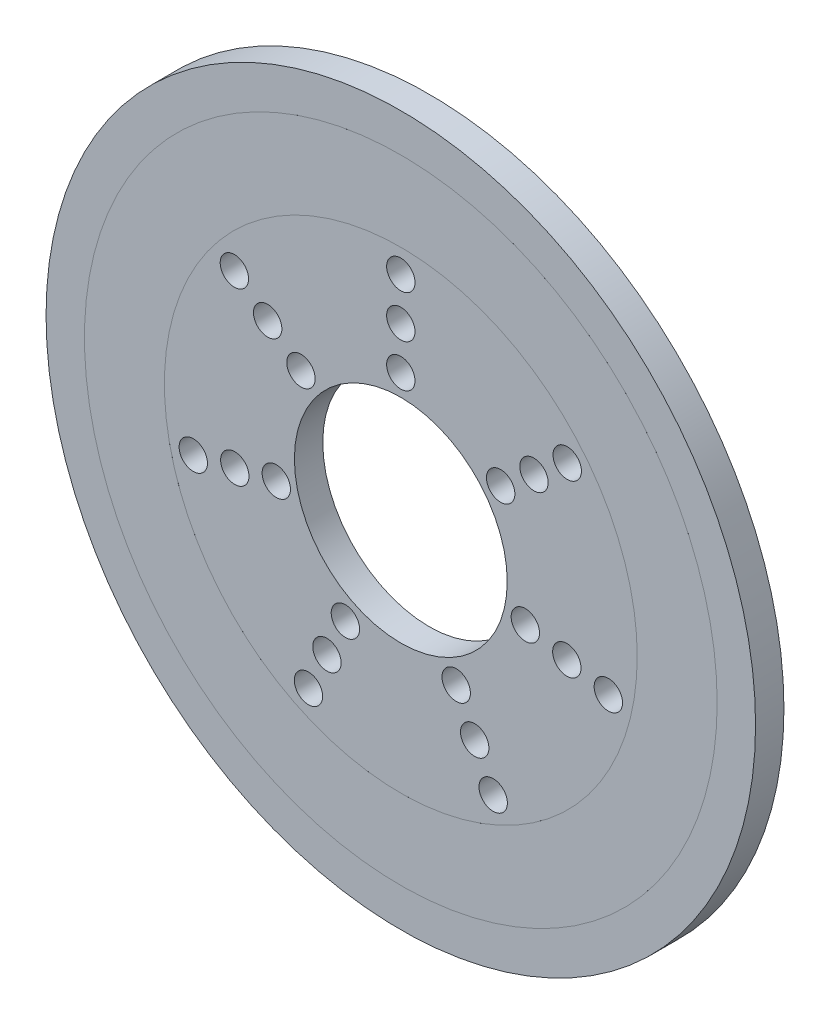
ISO-10303-21;
HEADER;
FILE_DESCRIPTION(('STEP AP214'),'2;1');
FILE_NAME('part.step','',(''),(''),'','','');
FILE_SCHEMA(('AUTOMOTIVE_DESIGN { 1 0 10303 214 1 1 1 1 }'));
ENDSEC;
DATA;
#1=APPLICATION_CONTEXT('core data for automotive mechanical design processes');
#2=APPLICATION_PROTOCOL_DEFINITION('international standard','automotive_design',2000,#1);
#3=PRODUCT_CONTEXT('',#1,'mechanical');
#4=PRODUCT('Part','Part','',(#3));
#5=PRODUCT_RELATED_PRODUCT_CATEGORY('part','',(#4));
#6=PRODUCT_DEFINITION_FORMATION('','',#4);
#7=PRODUCT_DEFINITION_CONTEXT('part definition',#1,'design');
#8=PRODUCT_DEFINITION('design','',#6,#7);
#9=PRODUCT_DEFINITION_SHAPE('','',#8);
#10=(LENGTH_UNIT() NAMED_UNIT(*) SI_UNIT(.MILLI.,.METRE.));
#11=(NAMED_UNIT(*) PLANE_ANGLE_UNIT() SI_UNIT($,.RADIAN.));
#12=(NAMED_UNIT(*) SI_UNIT($,.STERADIAN.) SOLID_ANGLE_UNIT());
#13=UNCERTAINTY_MEASURE_WITH_UNIT(LENGTH_MEASURE(1.E-05),#10,'distance_accuracy_value','');
#14=(GEOMETRIC_REPRESENTATION_CONTEXT(3) GLOBAL_UNCERTAINTY_ASSIGNED_CONTEXT((#13)) GLOBAL_UNIT_ASSIGNED_CONTEXT((#10,
#11,#12)) REPRESENTATION_CONTEXT('',''));
#15=CARTESIAN_POINT('',(0.,0.,0.));
#16=DIRECTION('',(0.,0.,1.));
#17=DIRECTION('',(1.,0.,0.));
#18=AXIS2_PLACEMENT_3D('',#15,#16,#17);
#19=CARTESIAN_POINT('',(0.,0.,10.));
#20=DIRECTION('',(0.,0.,1.));
#21=DIRECTION('',(1.,0.,0.));
#22=AXIS2_PLACEMENT_3D('',#19,#20,#21);
#23=PLANE('',#22);
#24=CARTESIAN_POINT('',(-46.9098889480758,37.4093881115113,10.));
#25=DIRECTION('',(0.,0.,1.));
#26=DIRECTION('',(1.,0.,0.));
#27=AXIS2_PLACEMENT_3D('',#24,#25,#26);
#28=CIRCLE('',#27,5.);
#29=CARTESIAN_POINT('',(-41.9098889480758,37.4093881115113,10.));
#30=VERTEX_POINT('',#29);
#31=EDGE_CURVE('E62',#30,#30,#28,.T.);
#32=ORIENTED_EDGE('',*,*,#31,.F.);
#33=EDGE_LOOP('',(#32));
#34=FACE_BOUND('',#33,.T.);
#35=CARTESIAN_POINT('',(-73.119593413617,-16.6890700467394,10.));
#36=DIRECTION('',(0.,0.,1.));
#37=DIRECTION('',(1.,0.,0.));
#38=AXIS2_PLACEMENT_3D('',#35,#36,#37);
#39=CIRCLE('',#38,5.);
#40=CARTESIAN_POINT('',(-68.119593413617,-16.6890700467394,10.));
#41=VERTEX_POINT('',#40);
#42=EDGE_CURVE('E74',#41,#41,#39,.T.);
#43=ORIENTED_EDGE('',*,*,#42,.F.);
#44=EDGE_LOOP('',(#43));
#45=FACE_BOUND('',#44,.T.);
#46=CARTESIAN_POINT('',(-43.8717560481623,-10.0134420280499,10.));
#47=DIRECTION('',(0.,0.,1.));
#48=DIRECTION('',(1.,0.,0.));
#49=AXIS2_PLACEMENT_3D('',#46,#47,#48);
#50=CIRCLE('',#49,5.);
#51=CARTESIAN_POINT('',(-38.8717560481623,-10.0134420280499,10.));
#52=VERTEX_POINT('',#51);
#53=EDGE_CURVE('E86',#52,#52,#50,.T.);
#54=ORIENTED_EDGE('',*,*,#53,.F.);
#55=EDGE_LOOP('',(#54));
#56=FACE_BOUND('',#55,.T.);
#57=CARTESIAN_POINT('',(-26.0330243470227,-54.0581320741522,10.));
#58=DIRECTION('',(0.,0.,1.));
#59=DIRECTION('',(1.,0.,0.));
#60=AXIS2_PLACEMENT_3D('',#57,#58,#59);
#61=CIRCLE('',#60,5.);
#62=CARTESIAN_POINT('',(-21.0330243470227,-54.0581320741522,10.));
#63=VERTEX_POINT('',#62);
#64=EDGE_CURVE('E98',#63,#63,#61,.T.);
#65=ORIENTED_EDGE('',*,*,#64,.F.);
#66=EDGE_LOOP('',(#65));
#67=FACE_BOUND('',#66,.T.);
#68=CARTESIAN_POINT('',(32.5412804338476,-67.5726650926744,10.));
#69=DIRECTION('',(0.,0.,1.));
#70=DIRECTION('',(1.,0.,0.));
#71=AXIS2_PLACEMENT_3D('',#68,#69,#70);
#72=CIRCLE('',#71,5.);
#73=CARTESIAN_POINT('',(37.5412804338476,-67.5726650926744,10.));
#74=VERTEX_POINT('',#73);
#75=EDGE_CURVE('E110',#74,#74,#72,.T.);
#76=ORIENTED_EDGE('',*,*,#75,.F.);
#77=EDGE_LOOP('',(#76));
#78=FACE_BOUND('',#77,.T.);
#79=CARTESIAN_POINT('',(19.5247682603208,-40.5435990556019,10.));
#80=DIRECTION('',(0.,0.,1.));
#81=DIRECTION('',(1.,0.,0.));
#82=AXIS2_PLACEMENT_3D('',#79,#80,#81);
#83=CIRCLE('',#82,5.);
#84=CARTESIAN_POINT('',(24.5247682603208,-40.5435990556019,10.));
#85=VERTEX_POINT('',#84);
#86=EDGE_CURVE('E122',#85,#85,#83,.T.);
#87=ORIENTED_EDGE('',*,*,#86,.F.);
#88=EDGE_LOOP('',(#87));
#89=FACE_BOUND('',#88,.T.);
#90=CARTESIAN_POINT('',(58.4956747309292,-13.3512560373631,10.));
#91=DIRECTION('',(0.,0.,1.));
#92=DIRECTION('',(1.,0.,0.));
#93=AXIS2_PLACEMENT_3D('',#90,#91,#92);
#94=CIRCLE('',#93,5.);
#95=CARTESIAN_POINT('',(63.4956747309292,-13.3512560373631,10.));
#96=VERTEX_POINT('',#95);
#97=EDGE_CURVE('E134',#96,#96,#94,.T.);
#98=ORIENTED_EDGE('',*,*,#97,.F.);
#99=EDGE_LOOP('',(#98));
#100=FACE_BOUND('',#99,.T.);
#101=CARTESIAN_POINT('',(58.6373611851082,46.7617351394177,10.));
#102=DIRECTION('',(0.,0.,1.));
#103=DIRECTION('',(1.,0.,0.));
#104=AXIS2_PLACEMENT_3D('',#101,#102,#103);
#105=CIRCLE('',#104,5.00000000000001);
#106=CARTESIAN_POINT('',(63.6373611851083,46.7617351394177,10.));
#107=VERTEX_POINT('',#106);
#108=EDGE_CURVE('E146',#107,#107,#105,.T.);
#109=ORIENTED_EDGE('',*,*,#108,.F.);
#110=EDGE_LOOP('',(#109));
#111=FACE_BOUND('',#110,.T.);
#112=CARTESIAN_POINT('',(35.1824167110674,28.0570410836556,10.));
#113=DIRECTION('',(0.,0.,1.));
#114=DIRECTION('',(1.,0.,0.));
#115=AXIS2_PLACEMENT_3D('',#112,#113,#114);
#116=CIRCLE('',#115,5.);
#117=CARTESIAN_POINT('',(40.1824167110674,28.0570410836556,10.));
#118=VERTEX_POINT('',#117);
#119=EDGE_CURVE('E158',#118,#118,#116,.T.);
#120=ORIENTED_EDGE('',*,*,#119,.F.);
#121=EDGE_LOOP('',(#120));
#122=FACE_BOUND('',#121,.T.);
#123=CARTESIAN_POINT('',(0.,60.,10.));
#124=DIRECTION('',(0.,0.,1.));
#125=DIRECTION('',(1.,0.,0.));
#126=AXIS2_PLACEMENT_3D('',#123,#124,#125);
#127=CIRCLE('',#126,5.);
#128=CARTESIAN_POINT('',(4.99999999999995,60.,10.));
#129=VERTEX_POINT('',#128);
#130=EDGE_CURVE('E170',#129,#129,#127,.T.);
#131=ORIENTED_EDGE('',*,*,#130,.F.);
#132=EDGE_LOOP('',(#131));
#133=FACE_BOUND('',#132,.T.);
#134=CARTESIAN_POINT('',(0.,0.,10.));
#135=DIRECTION('',(0.,0.,1.));
#136=DIRECTION('',(1.,0.,0.));
#137=AXIS2_PLACEMENT_3D('',#134,#135,#136);
#138=CIRCLE('',#137,37.5);
#139=CARTESIAN_POINT('',(37.5,0.,10.));
#140=VERTEX_POINT('',#139);
#141=EDGE_CURVE('E182',#140,#140,#138,.T.);
#142=ORIENTED_EDGE('',*,*,#141,.F.);
#143=EDGE_LOOP('',(#142));
#144=FACE_BOUND('',#143,.T.);
#145=CARTESIAN_POINT('',(0.,45.,10.));
#146=DIRECTION('',(0.,0.,1.));
#147=DIRECTION('',(1.,0.,0.));
#148=AXIS2_PLACEMENT_3D('',#145,#146,#147);
#149=CIRCLE('',#148,5.);
#150=CARTESIAN_POINT('',(5.,45.,10.));
#151=VERTEX_POINT('',#150);
#152=EDGE_CURVE('E176',#151,#151,#149,.T.);
#153=ORIENTED_EDGE('',*,*,#152,.F.);
#154=EDGE_LOOP('',(#153));
#155=FACE_BOUND('',#154,.T.);
#156=CARTESIAN_POINT('',(-1.04744440165294E-13,75.,10.));
#157=DIRECTION('',(0.,0.,1.));
#158=DIRECTION('',(1.,0.,0.));
#159=AXIS2_PLACEMENT_3D('',#156,#157,#158);
#160=CIRCLE('',#159,5.);
#161=CARTESIAN_POINT('',(4.9999999999999,75.,10.));
#162=VERTEX_POINT('',#161);
#163=EDGE_CURVE('E164',#162,#162,#160,.T.);
#164=ORIENTED_EDGE('',*,*,#163,.F.);
#165=EDGE_LOOP('',(#164));
#166=FACE_BOUND('',#165,.T.);
#167=CARTESIAN_POINT('',(46.9098889480878,37.4093881115367,10.));
#168=DIRECTION('',(0.,0.,1.));
#169=DIRECTION('',(1.,0.,0.));
#170=AXIS2_PLACEMENT_3D('',#167,#168,#169);
#171=CIRCLE('',#170,5.);
#172=CARTESIAN_POINT('',(51.9098889480878,37.4093881115367,10.));
#173=VERTEX_POINT('',#172);
#174=EDGE_CURVE('E152',#173,#173,#171,.T.);
#175=ORIENTED_EDGE('',*,*,#174,.F.);
#176=EDGE_LOOP('',(#175));
#177=FACE_BOUND('',#176,.T.);
#178=CARTESIAN_POINT('',(43.8717560482018,-10.0134420280184,10.));
#179=DIRECTION('',(0.,0.,1.));
#180=DIRECTION('',(1.,0.,0.));
#181=AXIS2_PLACEMENT_3D('',#178,#179,#180);
#182=CIRCLE('',#181,5.);
#183=CARTESIAN_POINT('',(48.8717560482018,-10.0134420280184,10.));
#184=VERTEX_POINT('',#183);
#185=EDGE_CURVE('E140',#184,#184,#182,.T.);
#186=ORIENTED_EDGE('',*,*,#185,.F.);
#187=EDGE_LOOP('',(#186));
#188=FACE_BOUND('',#187,.T.);
#189=CARTESIAN_POINT('',(73.1195934136565,-16.6890700467077,10.));
#190=DIRECTION('',(0.,0.,1.));
#191=DIRECTION('',(1.,0.,0.));
#192=AXIS2_PLACEMENT_3D('',#189,#190,#191);
#193=CIRCLE('',#192,5.);
#194=CARTESIAN_POINT('',(78.1195934136565,-16.6890700467077,10.));
#195=VERTEX_POINT('',#194);
#196=EDGE_CURVE('E128',#195,#195,#193,.T.);
#197=ORIENTED_EDGE('',*,*,#196,.F.);
#198=EDGE_LOOP('',(#197));
#199=FACE_BOUND('',#198,.T.);
#200=CARTESIAN_POINT('',(26.0330243470842,-54.0581320741381,10.));
#201=DIRECTION('',(0.,0.,1.));
#202=DIRECTION('',(1.,0.,0.));
#203=AXIS2_PLACEMENT_3D('',#200,#201,#202);
#204=CIRCLE('',#203,5.);
#205=CARTESIAN_POINT('',(31.0330243470842,-54.0581320741381,10.));
#206=VERTEX_POINT('',#205);
#207=EDGE_CURVE('E116',#206,#206,#204,.T.);
#208=ORIENTED_EDGE('',*,*,#207,.F.);
#209=EDGE_LOOP('',(#208));
#210=FACE_BOUND('',#209,.T.);
#211=CARTESIAN_POINT('',(-19.5247682602594,-40.5435990556159,10.));
#212=DIRECTION('',(0.,0.,1.));
#213=DIRECTION('',(1.,0.,0.));
#214=AXIS2_PLACEMENT_3D('',#211,#212,#213);
#215=CIRCLE('',#214,5.);
#216=CARTESIAN_POINT('',(-14.5247682602594,-40.5435990556159,10.));
#217=VERTEX_POINT('',#216);
#218=EDGE_CURVE('E104',#217,#217,#215,.T.);
#219=ORIENTED_EDGE('',*,*,#218,.F.);
#220=EDGE_LOOP('',(#219));
#221=FACE_BOUND('',#220,.T.);
#222=CARTESIAN_POINT('',(-32.5412804337861,-67.5726650926885,10.));
#223=DIRECTION('',(0.,0.,1.));
#224=DIRECTION('',(1.,0.,0.));
#225=AXIS2_PLACEMENT_3D('',#222,#223,#224);
#226=CIRCLE('',#225,5.);
#227=CARTESIAN_POINT('',(-27.5412804337861,-67.5726650926885,10.));
#228=VERTEX_POINT('',#227);
#229=EDGE_CURVE('E92',#228,#228,#226,.T.);
#230=ORIENTED_EDGE('',*,*,#229,.F.);
#231=EDGE_LOOP('',(#230));
#232=FACE_BOUND('',#231,.T.);
#233=CARTESIAN_POINT('',(-58.4956747308897,-13.3512560373947,10.));
#234=DIRECTION('',(0.,0.,1.));
#235=DIRECTION('',(1.,0.,0.));
#236=AXIS2_PLACEMENT_3D('',#233,#234,#235);
#237=CIRCLE('',#236,5.);
#238=CARTESIAN_POINT('',(-53.4956747308897,-13.3512560373947,10.));
#239=VERTEX_POINT('',#238);
#240=EDGE_CURVE('E80',#239,#239,#237,.T.);
#241=ORIENTED_EDGE('',*,*,#240,.F.);
#242=EDGE_LOOP('',(#241));
#243=FACE_BOUND('',#242,.T.);
#244=CARTESIAN_POINT('',(-35.1824167110553,28.0570410836304,10.));
#245=DIRECTION('',(0.,0.,1.));
#246=DIRECTION('',(1.,0.,0.));
#247=AXIS2_PLACEMENT_3D('',#244,#245,#246);
#248=CIRCLE('',#247,5.);
#249=CARTESIAN_POINT('',(-30.1824167110553,28.0570410836304,10.));
#250=VERTEX_POINT('',#249);
#251=EDGE_CURVE('E68',#250,#250,#248,.T.);
#252=ORIENTED_EDGE('',*,*,#251,.F.);
#253=EDGE_LOOP('',(#252));
#254=FACE_BOUND('',#253,.T.);
#255=CARTESIAN_POINT('',(-58.6373611850962,46.7617351393923,10.));
#256=DIRECTION('',(0.,0.,1.));
#257=DIRECTION('',(1.,0.,0.));
#258=AXIS2_PLACEMENT_3D('',#255,#256,#257);
#259=CIRCLE('',#258,5.);
#260=CARTESIAN_POINT('',(-53.6373611850962,46.7617351393923,10.));
#261=VERTEX_POINT('',#260);
#262=EDGE_CURVE('E55',#261,#261,#259,.T.);
#263=ORIENTED_EDGE('',*,*,#262,.F.);
#264=EDGE_LOOP('',(#263));
#265=FACE_BOUND('',#264,.T.);
#266=CARTESIAN_POINT('',(0.,0.,10.));
#267=DIRECTION('',(0.,0.,1.));
#268=DIRECTION('',(1.,0.,0.));
#269=AXIS2_PLACEMENT_3D('',#266,#267,#268);
#270=CIRCLE('',#269,83.3035848623197);
#271=CARTESIAN_POINT('',(83.3035848623197,0.,10.));
#272=VERTEX_POINT('',#271);
#273=EDGE_CURVE('E335',#272,#272,#270,.T.);
#274=ORIENTED_EDGE('',*,*,#273,.T.);
#275=EDGE_LOOP('',(#274));
#276=FACE_BOUND('',#275,.T.);
#277=ADVANCED_FACE('F31',(#34,#45,#56,#67,#78,#89,#100,#111,#122,#133,#144,#155,#166,#177,#188,
#199,#210,#221,#232,#243,#254,#265,#276),#23,.T.);
#278=CARTESIAN_POINT('',(0.,0.,0.));
#279=DIRECTION('',(0.,0.,1.));
#280=DIRECTION('',(1.,0.,0.));
#281=AXIS2_PLACEMENT_3D('',#278,#279,#280);
#282=PLANE('',#281);
#283=CARTESIAN_POINT('',(-58.6373611850962,46.7617351393923,0.));
#284=DIRECTION('',(0.,0.,1.));
#285=DIRECTION('',(1.,0.,0.));
#286=AXIS2_PLACEMENT_3D('',#283,#284,#285);
#287=CIRCLE('',#286,5.);
#288=CARTESIAN_POINT('',(-53.6373611850962,46.7617351393923,0.));
#289=VERTEX_POINT('',#288);
#290=EDGE_CURVE('E59',#289,#289,#287,.T.);
#291=ORIENTED_EDGE('',*,*,#290,.T.);
#292=EDGE_LOOP('',(#291));
#293=FACE_BOUND('',#292,.T.);
#294=CARTESIAN_POINT('',(-46.9098889480758,37.4093881115113,0.));
#295=DIRECTION('',(0.,0.,1.));
#296=DIRECTION('',(1.,0.,0.));
#297=AXIS2_PLACEMENT_3D('',#294,#295,#296);
#298=CIRCLE('',#297,5.);
#299=CARTESIAN_POINT('',(-41.9098889480758,37.4093881115113,0.));
#300=VERTEX_POINT('',#299);
#301=EDGE_CURVE('E58',#300,#300,#298,.T.);
#302=ORIENTED_EDGE('',*,*,#301,.T.);
#303=EDGE_LOOP('',(#302));
#304=FACE_BOUND('',#303,.T.);
#305=CARTESIAN_POINT('',(-35.1824167110553,28.0570410836304,0.));
#306=DIRECTION('',(0.,0.,1.));
#307=DIRECTION('',(1.,0.,0.));
#308=AXIS2_PLACEMENT_3D('',#305,#306,#307);
#309=CIRCLE('',#308,5.);
#310=CARTESIAN_POINT('',(-30.1824167110553,28.0570410836304,0.));
#311=VERTEX_POINT('',#310);
#312=EDGE_CURVE('E65',#311,#311,#309,.T.);
#313=ORIENTED_EDGE('',*,*,#312,.T.);
#314=EDGE_LOOP('',(#313));
#315=FACE_BOUND('',#314,.T.);
#316=CARTESIAN_POINT('',(-73.119593413617,-16.6890700467394,0.));
#317=DIRECTION('',(0.,0.,1.));
#318=DIRECTION('',(1.,0.,0.));
#319=AXIS2_PLACEMENT_3D('',#316,#317,#318);
#320=CIRCLE('',#319,5.);
#321=CARTESIAN_POINT('',(-68.119593413617,-16.6890700467394,0.));
#322=VERTEX_POINT('',#321);
#323=EDGE_CURVE('E71',#322,#322,#320,.T.);
#324=ORIENTED_EDGE('',*,*,#323,.T.);
#325=EDGE_LOOP('',(#324));
#326=FACE_BOUND('',#325,.T.);
#327=CARTESIAN_POINT('',(-58.4956747308897,-13.3512560373947,0.));
#328=DIRECTION('',(0.,0.,1.));
#329=DIRECTION('',(1.,0.,0.));
#330=AXIS2_PLACEMENT_3D('',#327,#328,#329);
#331=CIRCLE('',#330,5.);
#332=CARTESIAN_POINT('',(-53.4956747308897,-13.3512560373947,0.));
#333=VERTEX_POINT('',#332);
#334=EDGE_CURVE('E77',#333,#333,#331,.T.);
#335=ORIENTED_EDGE('',*,*,#334,.T.);
#336=EDGE_LOOP('',(#335));
#337=FACE_BOUND('',#336,.T.);
#338=CARTESIAN_POINT('',(-43.8717560481623,-10.0134420280499,0.));
#339=DIRECTION('',(0.,0.,1.));
#340=DIRECTION('',(1.,0.,0.));
#341=AXIS2_PLACEMENT_3D('',#338,#339,#340);
#342=CIRCLE('',#341,5.);
#343=CARTESIAN_POINT('',(-38.8717560481623,-10.0134420280499,0.));
#344=VERTEX_POINT('',#343);
#345=EDGE_CURVE('E83',#344,#344,#342,.T.);
#346=ORIENTED_EDGE('',*,*,#345,.T.);
#347=EDGE_LOOP('',(#346));
#348=FACE_BOUND('',#347,.T.);
#349=CARTESIAN_POINT('',(-32.5412804337861,-67.5726650926885,0.));
#350=DIRECTION('',(0.,0.,1.));
#351=DIRECTION('',(1.,0.,0.));
#352=AXIS2_PLACEMENT_3D('',#349,#350,#351);
#353=CIRCLE('',#352,5.);
#354=CARTESIAN_POINT('',(-27.5412804337861,-67.5726650926885,0.));
#355=VERTEX_POINT('',#354);
#356=EDGE_CURVE('E89',#355,#355,#353,.T.);
#357=ORIENTED_EDGE('',*,*,#356,.T.);
#358=EDGE_LOOP('',(#357));
#359=FACE_BOUND('',#358,.T.);
#360=CARTESIAN_POINT('',(-26.0330243470227,-54.0581320741522,0.));
#361=DIRECTION('',(0.,0.,1.));
#362=DIRECTION('',(1.,0.,0.));
#363=AXIS2_PLACEMENT_3D('',#360,#361,#362);
#364=CIRCLE('',#363,5.);
#365=CARTESIAN_POINT('',(-21.0330243470227,-54.0581320741522,0.));
#366=VERTEX_POINT('',#365);
#367=EDGE_CURVE('E95',#366,#366,#364,.T.);
#368=ORIENTED_EDGE('',*,*,#367,.T.);
#369=EDGE_LOOP('',(#368));
#370=FACE_BOUND('',#369,.T.);
#371=CARTESIAN_POINT('',(-19.5247682602594,-40.5435990556159,0.));
#372=DIRECTION('',(0.,0.,1.));
#373=DIRECTION('',(1.,0.,0.));
#374=AXIS2_PLACEMENT_3D('',#371,#372,#373);
#375=CIRCLE('',#374,5.);
#376=CARTESIAN_POINT('',(-14.5247682602594,-40.5435990556159,0.));
#377=VERTEX_POINT('',#376);
#378=EDGE_CURVE('E101',#377,#377,#375,.T.);
#379=ORIENTED_EDGE('',*,*,#378,.T.);
#380=EDGE_LOOP('',(#379));
#381=FACE_BOUND('',#380,.T.);
#382=CARTESIAN_POINT('',(32.5412804338476,-67.5726650926744,0.));
#383=DIRECTION('',(0.,0.,1.));
#384=DIRECTION('',(1.,0.,0.));
#385=AXIS2_PLACEMENT_3D('',#382,#383,#384);
#386=CIRCLE('',#385,5.);
#387=CARTESIAN_POINT('',(37.5412804338476,-67.5726650926744,0.));
#388=VERTEX_POINT('',#387);
#389=EDGE_CURVE('E107',#388,#388,#386,.T.);
#390=ORIENTED_EDGE('',*,*,#389,.T.);
#391=EDGE_LOOP('',(#390));
#392=FACE_BOUND('',#391,.T.);
#393=CARTESIAN_POINT('',(26.0330243470842,-54.0581320741381,0.));
#394=DIRECTION('',(0.,0.,1.));
#395=DIRECTION('',(1.,0.,0.));
#396=AXIS2_PLACEMENT_3D('',#393,#394,#395);
#397=CIRCLE('',#396,5.);
#398=CARTESIAN_POINT('',(31.0330243470842,-54.0581320741381,0.));
#399=VERTEX_POINT('',#398);
#400=EDGE_CURVE('E113',#399,#399,#397,.T.);
#401=ORIENTED_EDGE('',*,*,#400,.T.);
#402=EDGE_LOOP('',(#401));
#403=FACE_BOUND('',#402,.T.);
#404=CARTESIAN_POINT('',(19.5247682603208,-40.5435990556019,0.));
#405=DIRECTION('',(0.,0.,1.));
#406=DIRECTION('',(1.,0.,0.));
#407=AXIS2_PLACEMENT_3D('',#404,#405,#406);
#408=CIRCLE('',#407,5.);
#409=CARTESIAN_POINT('',(24.5247682603208,-40.5435990556019,0.));
#410=VERTEX_POINT('',#409);
#411=EDGE_CURVE('E119',#410,#410,#408,.T.);
#412=ORIENTED_EDGE('',*,*,#411,.T.);
#413=EDGE_LOOP('',(#412));
#414=FACE_BOUND('',#413,.T.);
#415=CARTESIAN_POINT('',(73.1195934136565,-16.6890700467077,0.));
#416=DIRECTION('',(0.,0.,1.));
#417=DIRECTION('',(1.,0.,0.));
#418=AXIS2_PLACEMENT_3D('',#415,#416,#417);
#419=CIRCLE('',#418,5.);
#420=CARTESIAN_POINT('',(78.1195934136565,-16.6890700467077,0.));
#421=VERTEX_POINT('',#420);
#422=EDGE_CURVE('E125',#421,#421,#419,.T.);
#423=ORIENTED_EDGE('',*,*,#422,.T.);
#424=EDGE_LOOP('',(#423));
#425=FACE_BOUND('',#424,.T.);
#426=CARTESIAN_POINT('',(58.4956747309292,-13.3512560373631,0.));
#427=DIRECTION('',(0.,0.,1.));
#428=DIRECTION('',(1.,0.,0.));
#429=AXIS2_PLACEMENT_3D('',#426,#427,#428);
#430=CIRCLE('',#429,5.);
#431=CARTESIAN_POINT('',(63.4956747309292,-13.3512560373631,0.));
#432=VERTEX_POINT('',#431);
#433=EDGE_CURVE('E131',#432,#432,#430,.T.);
#434=ORIENTED_EDGE('',*,*,#433,.T.);
#435=EDGE_LOOP('',(#434));
#436=FACE_BOUND('',#435,.T.);
#437=CARTESIAN_POINT('',(43.8717560482018,-10.0134420280184,0.));
#438=DIRECTION('',(0.,0.,1.));
#439=DIRECTION('',(1.,0.,0.));
#440=AXIS2_PLACEMENT_3D('',#437,#438,#439);
#441=CIRCLE('',#440,5.);
#442=CARTESIAN_POINT('',(48.8717560482018,-10.0134420280184,0.));
#443=VERTEX_POINT('',#442);
#444=EDGE_CURVE('E137',#443,#443,#441,.T.);
#445=ORIENTED_EDGE('',*,*,#444,.T.);
#446=EDGE_LOOP('',(#445));
#447=FACE_BOUND('',#446,.T.);
#448=CARTESIAN_POINT('',(58.6373611851082,46.7617351394177,0.));
#449=DIRECTION('',(0.,0.,1.));
#450=DIRECTION('',(1.,0.,0.));
#451=AXIS2_PLACEMENT_3D('',#448,#449,#450);
#452=CIRCLE('',#451,5.00000000000001);
#453=CARTESIAN_POINT('',(63.6373611851083,46.7617351394177,0.));
#454=VERTEX_POINT('',#453);
#455=EDGE_CURVE('E143',#454,#454,#452,.T.);
#456=ORIENTED_EDGE('',*,*,#455,.T.);
#457=EDGE_LOOP('',(#456));
#458=FACE_BOUND('',#457,.T.);
#459=CARTESIAN_POINT('',(46.9098889480878,37.4093881115367,0.));
#460=DIRECTION('',(0.,0.,1.));
#461=DIRECTION('',(1.,0.,0.));
#462=AXIS2_PLACEMENT_3D('',#459,#460,#461);
#463=CIRCLE('',#462,5.);
#464=CARTESIAN_POINT('',(51.9098889480878,37.4093881115367,0.));
#465=VERTEX_POINT('',#464);
#466=EDGE_CURVE('E149',#465,#465,#463,.T.);
#467=ORIENTED_EDGE('',*,*,#466,.T.);
#468=EDGE_LOOP('',(#467));
#469=FACE_BOUND('',#468,.T.);
#470=CARTESIAN_POINT('',(35.1824167110674,28.0570410836556,0.));
#471=DIRECTION('',(0.,0.,1.));
#472=DIRECTION('',(1.,0.,0.));
#473=AXIS2_PLACEMENT_3D('',#470,#471,#472);
#474=CIRCLE('',#473,5.);
#475=CARTESIAN_POINT('',(40.1824167110674,28.0570410836556,0.));
#476=VERTEX_POINT('',#475);
#477=EDGE_CURVE('E155',#476,#476,#474,.T.);
#478=ORIENTED_EDGE('',*,*,#477,.T.);
#479=EDGE_LOOP('',(#478));
#480=FACE_BOUND('',#479,.T.);
#481=CARTESIAN_POINT('',(-1.04744440165294E-13,75.,0.));
#482=DIRECTION('',(0.,0.,1.));
#483=DIRECTION('',(1.,0.,0.));
#484=AXIS2_PLACEMENT_3D('',#481,#482,#483);
#485=CIRCLE('',#484,5.);
#486=CARTESIAN_POINT('',(4.9999999999999,75.,0.));
#487=VERTEX_POINT('',#486);
#488=EDGE_CURVE('E161',#487,#487,#485,.T.);
#489=ORIENTED_EDGE('',*,*,#488,.T.);
#490=EDGE_LOOP('',(#489));
#491=FACE_BOUND('',#490,.T.);
#492=CARTESIAN_POINT('',(0.,60.,0.));
#493=DIRECTION('',(0.,0.,1.));
#494=DIRECTION('',(1.,0.,0.));
#495=AXIS2_PLACEMENT_3D('',#492,#493,#494);
#496=CIRCLE('',#495,5.);
#497=CARTESIAN_POINT('',(4.99999999999995,60.,0.));
#498=VERTEX_POINT('',#497);
#499=EDGE_CURVE('E167',#498,#498,#496,.T.);
#500=ORIENTED_EDGE('',*,*,#499,.T.);
#501=EDGE_LOOP('',(#500));
#502=FACE_BOUND('',#501,.T.);
#503=CARTESIAN_POINT('',(0.,45.,0.));
#504=DIRECTION('',(0.,0.,1.));
#505=DIRECTION('',(1.,0.,0.));
#506=AXIS2_PLACEMENT_3D('',#503,#504,#505);
#507=CIRCLE('',#506,5.);
#508=CARTESIAN_POINT('',(5.,45.,0.));
#509=VERTEX_POINT('',#508);
#510=EDGE_CURVE('E173',#509,#509,#507,.T.);
#511=ORIENTED_EDGE('',*,*,#510,.T.);
#512=EDGE_LOOP('',(#511));
#513=FACE_BOUND('',#512,.T.);
#514=CARTESIAN_POINT('',(0.,0.,0.));
#515=DIRECTION('',(0.,0.,1.));
#516=DIRECTION('',(1.,0.,0.));
#517=AXIS2_PLACEMENT_3D('',#514,#515,#516);
#518=CIRCLE('',#517,37.5);
#519=CARTESIAN_POINT('',(37.5,0.,0.));
#520=VERTEX_POINT('',#519);
#521=EDGE_CURVE('E179',#520,#520,#518,.T.);
#522=ORIENTED_EDGE('',*,*,#521,.T.);
#523=EDGE_LOOP('',(#522));
#524=FACE_BOUND('',#523,.T.);
#525=CARTESIAN_POINT('',(0.,0.,0.));
#526=DIRECTION('',(0.,0.,1.));
#527=DIRECTION('',(1.,0.,0.));
#528=AXIS2_PLACEMENT_3D('',#525,#526,#527);
#529=CIRCLE('',#528,83.3035848623197);
#530=CARTESIAN_POINT('',(83.3035848623197,0.,0.));
#531=VERTEX_POINT('',#530);
#532=EDGE_CURVE('E39',#531,#531,#529,.T.);
#533=ORIENTED_EDGE('',*,*,#532,.F.);
#534=EDGE_LOOP('',(#533));
#535=FACE_BOUND('',#534,.T.);
#536=ADVANCED_FACE('F198',(#293,#304,#315,#326,#337,#348,#359,#370,#381,#392,#403,#414,#425,
#436,#447,#458,#469,#480,#491,#502,#513,#524,#535),#282,.F.);
#537=CARTESIAN_POINT('',(0.,0.,10.));
#538=DIRECTION('',(0.,0.,1.));
#539=DIRECTION('',(1.,0.,0.));
#540=AXIS2_PLACEMENT_3D('',#537,#538,#539);
#541=CIRCLE('',#540,111.468965797541);
#542=CARTESIAN_POINT('',(111.468965797541,0.,10.));
#543=VERTEX_POINT('',#542);
#544=EDGE_CURVE('E10',#543,#543,#541,.T.);
#545=ORIENTED_EDGE('',*,*,#544,.F.);
#546=EDGE_LOOP('',(#545));
#547=FACE_BOUND('',#546,.T.);
#548=CARTESIAN_POINT('',(0.,0.,10.));
#549=DIRECTION('',(0.,0.,1.));
#550=DIRECTION('',(1.,0.,0.));
#551=AXIS2_PLACEMENT_3D('',#548,#549,#550);
#552=CIRCLE('',#551,125.);
#553=CARTESIAN_POINT('',(125.,0.,10.));
#554=VERTEX_POINT('',#553);
#555=EDGE_CURVE('E44',#554,#554,#552,.T.);
#556=ORIENTED_EDGE('',*,*,#555,.T.);
#557=EDGE_LOOP('',(#556));
#558=FACE_BOUND('',#557,.T.);
#559=ADVANCED_FACE('F196',(#547,#558),#23,.T.);
#560=CARTESIAN_POINT('',(0.,0.,0.));
#561=DIRECTION('',(0.,0.,1.));
#562=DIRECTION('',(1.,0.,0.));
#563=AXIS2_PLACEMENT_3D('',#560,#561,#562);
#564=CIRCLE('',#563,111.468965797541);
#565=CARTESIAN_POINT('',(111.468965797541,0.,0.));
#566=VERTEX_POINT('',#565);
#567=EDGE_CURVE('E35',#566,#566,#564,.T.);
#568=ORIENTED_EDGE('',*,*,#567,.T.);
#569=EDGE_LOOP('',(#568));
#570=FACE_BOUND('',#569,.T.);
#571=CARTESIAN_POINT('',(0.,0.,0.));
#572=DIRECTION('',(0.,0.,1.));
#573=DIRECTION('',(1.,0.,0.));
#574=AXIS2_PLACEMENT_3D('',#571,#572,#573);
#575=CIRCLE('',#574,125.);
#576=CARTESIAN_POINT('',(125.,0.,0.));
#577=VERTEX_POINT('',#576);
#578=EDGE_CURVE('E185',#577,#577,#575,.T.);
#579=ORIENTED_EDGE('',*,*,#578,.F.);
#580=EDGE_LOOP('',(#579));
#581=FACE_BOUND('',#580,.T.);
#582=ADVANCED_FACE('F194',(#570,#581),#282,.F.);
#583=CARTESIAN_POINT('',(0.,0.,10.));
#584=DIRECTION('',(0.,0.,-1.));
#585=DIRECTION('',(-1.,0.,0.));
#586=AXIS2_PLACEMENT_3D('',#583,#584,#585);
#587=CYLINDRICAL_SURFACE('',#586,125.);
#588=ORIENTED_EDGE('',*,*,#555,.F.);
#589=EDGE_LOOP('',(#588));
#590=FACE_BOUND('',#589,.T.);
#591=ORIENTED_EDGE('',*,*,#578,.T.);
#592=EDGE_LOOP('',(#591));
#593=FACE_BOUND('',#592,.T.);
#594=ADVANCED_FACE('F33',(#590,#593),#587,.T.);
#595=CARTESIAN_POINT('',(0.,0.,10.));
#596=DIRECTION('',(0.,0.,-1.));
#597=DIRECTION('',(-1.,0.,0.));
#598=AXIS2_PLACEMENT_3D('',#595,#596,#597);
#599=CYLINDRICAL_SURFACE('',#598,37.5);
#600=ORIENTED_EDGE('',*,*,#141,.T.);
#601=EDGE_LOOP('',(#600));
#602=FACE_BOUND('',#601,.T.);
#603=ORIENTED_EDGE('',*,*,#521,.F.);
#604=EDGE_LOOP('',(#603));
#605=FACE_BOUND('',#604,.T.);
#606=ADVANCED_FACE('F203',(#602,#605),#599,.F.);
#607=CARTESIAN_POINT('',(0.,45.,10.));
#608=DIRECTION('',(0.,0.,-1.));
#609=DIRECTION('',(-1.,0.,0.));
#610=AXIS2_PLACEMENT_3D('',#607,#608,#609);
#611=CYLINDRICAL_SURFACE('',#610,5.);
#612=ORIENTED_EDGE('',*,*,#152,.T.);
#613=EDGE_LOOP('',(#612));
#614=FACE_BOUND('',#613,.T.);
#615=ORIENTED_EDGE('',*,*,#510,.F.);
#616=EDGE_LOOP('',(#615));
#617=FACE_BOUND('',#616,.T.);
#618=ADVANCED_FACE('F219',(#614,#617),#611,.F.);
#619=CARTESIAN_POINT('',(0.,60.,10.));
#620=DIRECTION('',(0.,0.,-1.));
#621=DIRECTION('',(-1.,0.,0.));
#622=AXIS2_PLACEMENT_3D('',#619,#620,#621);
#623=CYLINDRICAL_SURFACE('',#622,5.);
#624=ORIENTED_EDGE('',*,*,#130,.T.);
#625=EDGE_LOOP('',(#624));
#626=FACE_BOUND('',#625,.T.);
#627=ORIENTED_EDGE('',*,*,#499,.F.);
#628=EDGE_LOOP('',(#627));
#629=FACE_BOUND('',#628,.T.);
#630=ADVANCED_FACE('F223',(#626,#629),#623,.F.);
#631=CARTESIAN_POINT('',(-1.04744440165294E-13,75.,10.));
#632=DIRECTION('',(0.,0.,-1.));
#633=DIRECTION('',(-1.,0.,0.));
#634=AXIS2_PLACEMENT_3D('',#631,#632,#633);
#635=CYLINDRICAL_SURFACE('',#634,5.);
#636=ORIENTED_EDGE('',*,*,#163,.T.);
#637=EDGE_LOOP('',(#636));
#638=FACE_BOUND('',#637,.T.);
#639=ORIENTED_EDGE('',*,*,#488,.F.);
#640=EDGE_LOOP('',(#639));
#641=FACE_BOUND('',#640,.T.);
#642=ADVANCED_FACE('F227',(#638,#641),#635,.F.);
#643=CARTESIAN_POINT('',(35.1824167110674,28.0570410836556,10.));
#644=DIRECTION('',(0.,0.,-1.));
#645=DIRECTION('',(-1.,0.,0.));
#646=AXIS2_PLACEMENT_3D('',#643,#644,#645);
#647=CYLINDRICAL_SURFACE('',#646,5.);
#648=ORIENTED_EDGE('',*,*,#119,.T.);
#649=EDGE_LOOP('',(#648));
#650=FACE_BOUND('',#649,.T.);
#651=ORIENTED_EDGE('',*,*,#477,.F.);
#652=EDGE_LOOP('',(#651));
#653=FACE_BOUND('',#652,.T.);
#654=ADVANCED_FACE('F231',(#650,#653),#647,.F.);
#655=CARTESIAN_POINT('',(46.9098889480878,37.4093881115367,10.));
#656=DIRECTION('',(0.,0.,-1.));
#657=DIRECTION('',(-1.,0.,0.));
#658=AXIS2_PLACEMENT_3D('',#655,#656,#657);
#659=CYLINDRICAL_SURFACE('',#658,5.);
#660=ORIENTED_EDGE('',*,*,#174,.T.);
#661=EDGE_LOOP('',(#660));
#662=FACE_BOUND('',#661,.T.);
#663=ORIENTED_EDGE('',*,*,#466,.F.);
#664=EDGE_LOOP('',(#663));
#665=FACE_BOUND('',#664,.T.);
#666=ADVANCED_FACE('F235',(#662,#665),#659,.F.);
#667=CARTESIAN_POINT('',(58.6373611851082,46.7617351394177,10.));
#668=DIRECTION('',(0.,0.,-1.));
#669=DIRECTION('',(-1.,0.,0.));
#670=AXIS2_PLACEMENT_3D('',#667,#668,#669);
#671=CYLINDRICAL_SURFACE('',#670,5.00000000000001);
#672=ORIENTED_EDGE('',*,*,#108,.T.);
#673=EDGE_LOOP('',(#672));
#674=FACE_BOUND('',#673,.T.);
#675=ORIENTED_EDGE('',*,*,#455,.F.);
#676=EDGE_LOOP('',(#675));
#677=FACE_BOUND('',#676,.T.);
#678=ADVANCED_FACE('F239',(#674,#677),#671,.F.);
#679=CARTESIAN_POINT('',(43.8717560482018,-10.0134420280184,10.));
#680=DIRECTION('',(0.,0.,-1.));
#681=DIRECTION('',(-1.,0.,0.));
#682=AXIS2_PLACEMENT_3D('',#679,#680,#681);
#683=CYLINDRICAL_SURFACE('',#682,5.);
#684=ORIENTED_EDGE('',*,*,#185,.T.);
#685=EDGE_LOOP('',(#684));
#686=FACE_BOUND('',#685,.T.);
#687=ORIENTED_EDGE('',*,*,#444,.F.);
#688=EDGE_LOOP('',(#687));
#689=FACE_BOUND('',#688,.T.);
#690=ADVANCED_FACE('F243',(#686,#689),#683,.F.);
#691=CARTESIAN_POINT('',(58.4956747309292,-13.3512560373631,10.));
#692=DIRECTION('',(0.,0.,-1.));
#693=DIRECTION('',(-1.,0.,0.));
#694=AXIS2_PLACEMENT_3D('',#691,#692,#693);
#695=CYLINDRICAL_SURFACE('',#694,5.);
#696=ORIENTED_EDGE('',*,*,#97,.T.);
#697=EDGE_LOOP('',(#696));
#698=FACE_BOUND('',#697,.T.);
#699=ORIENTED_EDGE('',*,*,#433,.F.);
#700=EDGE_LOOP('',(#699));
#701=FACE_BOUND('',#700,.T.);
#702=ADVANCED_FACE('F247',(#698,#701),#695,.F.);
#703=CARTESIAN_POINT('',(73.1195934136565,-16.6890700467077,10.));
#704=DIRECTION('',(0.,0.,-1.));
#705=DIRECTION('',(-1.,0.,0.));
#706=AXIS2_PLACEMENT_3D('',#703,#704,#705);
#707=CYLINDRICAL_SURFACE('',#706,5.);
#708=ORIENTED_EDGE('',*,*,#196,.T.);
#709=EDGE_LOOP('',(#708));
#710=FACE_BOUND('',#709,.T.);
#711=ORIENTED_EDGE('',*,*,#422,.F.);
#712=EDGE_LOOP('',(#711));
#713=FACE_BOUND('',#712,.T.);
#714=ADVANCED_FACE('F251',(#710,#713),#707,.F.);
#715=CARTESIAN_POINT('',(19.5247682603208,-40.5435990556019,10.));
#716=DIRECTION('',(0.,0.,-1.));
#717=DIRECTION('',(-1.,0.,0.));
#718=AXIS2_PLACEMENT_3D('',#715,#716,#717);
#719=CYLINDRICAL_SURFACE('',#718,5.);
#720=ORIENTED_EDGE('',*,*,#86,.T.);
#721=EDGE_LOOP('',(#720));
#722=FACE_BOUND('',#721,.T.);
#723=ORIENTED_EDGE('',*,*,#411,.F.);
#724=EDGE_LOOP('',(#723));
#725=FACE_BOUND('',#724,.T.);
#726=ADVANCED_FACE('F255',(#722,#725),#719,.F.);
#727=CARTESIAN_POINT('',(26.0330243470842,-54.0581320741381,10.));
#728=DIRECTION('',(0.,0.,-1.));
#729=DIRECTION('',(-1.,0.,0.));
#730=AXIS2_PLACEMENT_3D('',#727,#728,#729);
#731=CYLINDRICAL_SURFACE('',#730,5.);
#732=ORIENTED_EDGE('',*,*,#207,.T.);
#733=EDGE_LOOP('',(#732));
#734=FACE_BOUND('',#733,.T.);
#735=ORIENTED_EDGE('',*,*,#400,.F.);
#736=EDGE_LOOP('',(#735));
#737=FACE_BOUND('',#736,.T.);
#738=ADVANCED_FACE('F259',(#734,#737),#731,.F.);
#739=CARTESIAN_POINT('',(32.5412804338476,-67.5726650926744,10.));
#740=DIRECTION('',(0.,0.,-1.));
#741=DIRECTION('',(-1.,0.,0.));
#742=AXIS2_PLACEMENT_3D('',#739,#740,#741);
#743=CYLINDRICAL_SURFACE('',#742,5.);
#744=ORIENTED_EDGE('',*,*,#75,.T.);
#745=EDGE_LOOP('',(#744));
#746=FACE_BOUND('',#745,.T.);
#747=ORIENTED_EDGE('',*,*,#389,.F.);
#748=EDGE_LOOP('',(#747));
#749=FACE_BOUND('',#748,.T.);
#750=ADVANCED_FACE('F263',(#746,#749),#743,.F.);
#751=CARTESIAN_POINT('',(-19.5247682602594,-40.5435990556159,10.));
#752=DIRECTION('',(0.,0.,-1.));
#753=DIRECTION('',(-1.,0.,0.));
#754=AXIS2_PLACEMENT_3D('',#751,#752,#753);
#755=CYLINDRICAL_SURFACE('',#754,5.);
#756=ORIENTED_EDGE('',*,*,#218,.T.);
#757=EDGE_LOOP('',(#756));
#758=FACE_BOUND('',#757,.T.);
#759=ORIENTED_EDGE('',*,*,#378,.F.);
#760=EDGE_LOOP('',(#759));
#761=FACE_BOUND('',#760,.T.);
#762=ADVANCED_FACE('F267',(#758,#761),#755,.F.);
#763=CARTESIAN_POINT('',(-26.0330243470227,-54.0581320741522,10.));
#764=DIRECTION('',(0.,0.,-1.));
#765=DIRECTION('',(-1.,0.,0.));
#766=AXIS2_PLACEMENT_3D('',#763,#764,#765);
#767=CYLINDRICAL_SURFACE('',#766,5.);
#768=ORIENTED_EDGE('',*,*,#64,.T.);
#769=EDGE_LOOP('',(#768));
#770=FACE_BOUND('',#769,.T.);
#771=ORIENTED_EDGE('',*,*,#367,.F.);
#772=EDGE_LOOP('',(#771));
#773=FACE_BOUND('',#772,.T.);
#774=ADVANCED_FACE('F271',(#770,#773),#767,.F.);
#775=CARTESIAN_POINT('',(-32.5412804337861,-67.5726650926885,10.));
#776=DIRECTION('',(0.,0.,-1.));
#777=DIRECTION('',(-1.,0.,0.));
#778=AXIS2_PLACEMENT_3D('',#775,#776,#777);
#779=CYLINDRICAL_SURFACE('',#778,5.);
#780=ORIENTED_EDGE('',*,*,#229,.T.);
#781=EDGE_LOOP('',(#780));
#782=FACE_BOUND('',#781,.T.);
#783=ORIENTED_EDGE('',*,*,#356,.F.);
#784=EDGE_LOOP('',(#783));
#785=FACE_BOUND('',#784,.T.);
#786=ADVANCED_FACE('F275',(#782,#785),#779,.F.);
#787=CARTESIAN_POINT('',(-43.8717560481623,-10.0134420280499,10.));
#788=DIRECTION('',(0.,0.,-1.));
#789=DIRECTION('',(-1.,0.,0.));
#790=AXIS2_PLACEMENT_3D('',#787,#788,#789);
#791=CYLINDRICAL_SURFACE('',#790,5.);
#792=ORIENTED_EDGE('',*,*,#53,.T.);
#793=EDGE_LOOP('',(#792));
#794=FACE_BOUND('',#793,.T.);
#795=ORIENTED_EDGE('',*,*,#345,.F.);
#796=EDGE_LOOP('',(#795));
#797=FACE_BOUND('',#796,.T.);
#798=ADVANCED_FACE('F279',(#794,#797),#791,.F.);
#799=CARTESIAN_POINT('',(-58.4956747308897,-13.3512560373947,10.));
#800=DIRECTION('',(0.,0.,-1.));
#801=DIRECTION('',(-1.,0.,0.));
#802=AXIS2_PLACEMENT_3D('',#799,#800,#801);
#803=CYLINDRICAL_SURFACE('',#802,5.);
#804=ORIENTED_EDGE('',*,*,#240,.T.);
#805=EDGE_LOOP('',(#804));
#806=FACE_BOUND('',#805,.T.);
#807=ORIENTED_EDGE('',*,*,#334,.F.);
#808=EDGE_LOOP('',(#807));
#809=FACE_BOUND('',#808,.T.);
#810=ADVANCED_FACE('F283',(#806,#809),#803,.F.);
#811=CARTESIAN_POINT('',(-73.119593413617,-16.6890700467394,10.));
#812=DIRECTION('',(0.,0.,-1.));
#813=DIRECTION('',(-1.,0.,0.));
#814=AXIS2_PLACEMENT_3D('',#811,#812,#813);
#815=CYLINDRICAL_SURFACE('',#814,5.);
#816=ORIENTED_EDGE('',*,*,#42,.T.);
#817=EDGE_LOOP('',(#816));
#818=FACE_BOUND('',#817,.T.);
#819=ORIENTED_EDGE('',*,*,#323,.F.);
#820=EDGE_LOOP('',(#819));
#821=FACE_BOUND('',#820,.T.);
#822=ADVANCED_FACE('F287',(#818,#821),#815,.F.);
#823=CARTESIAN_POINT('',(-35.1824167110553,28.0570410836304,10.));
#824=DIRECTION('',(0.,0.,-1.));
#825=DIRECTION('',(-1.,0.,0.));
#826=AXIS2_PLACEMENT_3D('',#823,#824,#825);
#827=CYLINDRICAL_SURFACE('',#826,5.);
#828=ORIENTED_EDGE('',*,*,#251,.T.);
#829=EDGE_LOOP('',(#828));
#830=FACE_BOUND('',#829,.T.);
#831=ORIENTED_EDGE('',*,*,#312,.F.);
#832=EDGE_LOOP('',(#831));
#833=FACE_BOUND('',#832,.T.);
#834=ADVANCED_FACE('F291',(#830,#833),#827,.F.);
#835=CARTESIAN_POINT('',(-46.9098889480758,37.4093881115113,10.));
#836=DIRECTION('',(0.,0.,-1.));
#837=DIRECTION('',(-1.,0.,0.));
#838=AXIS2_PLACEMENT_3D('',#835,#836,#837);
#839=CYLINDRICAL_SURFACE('',#838,5.);
#840=ORIENTED_EDGE('',*,*,#31,.T.);
#841=EDGE_LOOP('',(#840));
#842=FACE_BOUND('',#841,.T.);
#843=ORIENTED_EDGE('',*,*,#301,.F.);
#844=EDGE_LOOP('',(#843));
#845=FACE_BOUND('',#844,.T.);
#846=ADVANCED_FACE('F295',(#842,#845),#839,.F.);
#847=CARTESIAN_POINT('',(-58.6373611850962,46.7617351393923,10.));
#848=DIRECTION('',(0.,0.,-1.));
#849=DIRECTION('',(-1.,0.,0.));
#850=AXIS2_PLACEMENT_3D('',#847,#848,#849);
#851=CYLINDRICAL_SURFACE('',#850,5.);
#852=ORIENTED_EDGE('',*,*,#262,.T.);
#853=EDGE_LOOP('',(#852));
#854=FACE_BOUND('',#853,.T.);
#855=ORIENTED_EDGE('',*,*,#290,.F.);
#856=EDGE_LOOP('',(#855));
#857=FACE_BOUND('',#856,.T.);
#858=ADVANCED_FACE('F299',(#854,#857),#851,.F.);
#859=CARTESIAN_POINT('',(0.,0.,-0.000999999999999265));
#860=DIRECTION('',(0.,0.,1.));
#861=DIRECTION('',(1.,0.,0.));
#862=AXIS2_PLACEMENT_3D('',#859,#860,#861);
#863=CYLINDRICAL_SURFACE('',#862,111.468965797541);
#864=CARTESIAN_POINT('',(0.,0.,-0.000999999999999265));
#865=DIRECTION('',(0.,0.,1.));
#866=DIRECTION('',(1.,0.,0.));
#867=AXIS2_PLACEMENT_3D('',#864,#865,#866);
#868=CIRCLE('',#867,111.468965797541);
#869=CARTESIAN_POINT('',(111.468965797541,0.,-0.000999999999999265));
#870=VERTEX_POINT('',#869);
#871=EDGE_CURVE('E52',#870,#870,#868,.T.);
#872=ORIENTED_EDGE('',*,*,#871,.T.);
#873=EDGE_LOOP('',(#872));
#874=FACE_BOUND('',#873,.T.);
#875=ORIENTED_EDGE('',*,*,#567,.F.);
#876=EDGE_LOOP('',(#875));
#877=FACE_BOUND('',#876,.T.);
#878=ADVANCED_FACE('F303',(#874,#877),#863,.T.);
#879=CARTESIAN_POINT('',(0.,0.,-0.000999999999999265));
#880=DIRECTION('',(0.,0.,1.));
#881=DIRECTION('',(1.,0.,0.));
#882=AXIS2_PLACEMENT_3D('',#879,#880,#881);
#883=CYLINDRICAL_SURFACE('',#882,83.3035848623197);
#884=CARTESIAN_POINT('',(0.,0.,-0.000999999999999265));
#885=DIRECTION('',(0.,0.,1.));
#886=DIRECTION('',(1.,0.,0.));
#887=AXIS2_PLACEMENT_3D('',#884,#885,#886);
#888=CIRCLE('',#887,83.3035848623197);
#889=CARTESIAN_POINT('',(83.3035848623197,0.,-0.000999999999999265));
#890=VERTEX_POINT('',#889);
#891=EDGE_CURVE('E49',#890,#890,#888,.T.);
#892=ORIENTED_EDGE('',*,*,#891,.F.);
#893=EDGE_LOOP('',(#892));
#894=FACE_BOUND('',#893,.T.);
#895=ORIENTED_EDGE('',*,*,#532,.T.);
#896=EDGE_LOOP('',(#895));
#897=FACE_BOUND('',#896,.T.);
#898=ADVANCED_FACE('F307',(#894,#897),#883,.F.);
#899=CARTESIAN_POINT('',(0.,0.,-0.000999999999999265));
#900=DIRECTION('',(0.,0.,1.));
#901=DIRECTION('',(1.,0.,0.));
#902=AXIS2_PLACEMENT_3D('',#899,#900,#901);
#903=PLANE('',#902);
#904=ORIENTED_EDGE('',*,*,#891,.T.);
#905=EDGE_LOOP('',(#904));
#906=FACE_BOUND('',#905,.T.);
#907=ORIENTED_EDGE('',*,*,#871,.F.);
#908=EDGE_LOOP('',(#907));
#909=FACE_BOUND('',#908,.T.);
#910=ADVANCED_FACE('F309',(#906,#909),#903,.F.);
#911=CARTESIAN_POINT('',(0.,0.,10.001));
#912=DIRECTION('',(0.,0.,1.));
#913=DIRECTION('',(1.,0.,0.));
#914=AXIS2_PLACEMENT_3D('',#911,#912,#913);
#915=PLANE('',#914);
#916=CARTESIAN_POINT('',(0.,0.,10.001));
#917=DIRECTION('',(0.,0.,1.));
#918=DIRECTION('',(1.,0.,0.));
#919=AXIS2_PLACEMENT_3D('',#916,#917,#918);
#920=CIRCLE('',#919,111.468965797541);
#921=CARTESIAN_POINT('',(111.468965797541,0.,10.001));
#922=VERTEX_POINT('',#921);
#923=EDGE_CURVE('E47',#922,#922,#920,.T.);
#924=ORIENTED_EDGE('',*,*,#923,.T.);
#925=EDGE_LOOP('',(#924));
#926=FACE_BOUND('',#925,.T.);
#927=CARTESIAN_POINT('',(0.,0.,10.001));
#928=DIRECTION('',(0.,0.,1.));
#929=DIRECTION('',(1.,0.,0.));
#930=AXIS2_PLACEMENT_3D('',#927,#928,#929);
#931=CIRCLE('',#930,83.3035848623197);
#932=CARTESIAN_POINT('',(83.3035848623197,0.,10.001));
#933=VERTEX_POINT('',#932);
#934=EDGE_CURVE('E332',#933,#933,#931,.T.);
#935=ORIENTED_EDGE('',*,*,#934,.F.);
#936=EDGE_LOOP('',(#935));
#937=FACE_BOUND('',#936,.T.);
#938=ADVANCED_FACE('F312',(#926,#937),#915,.T.);
#939=CARTESIAN_POINT('',(0.,0.,10.001));
#940=DIRECTION('',(0.,0.,-1.));
#941=DIRECTION('',(-1.,0.,0.));
#942=AXIS2_PLACEMENT_3D('',#939,#940,#941);
#943=CYLINDRICAL_SURFACE('',#942,111.468965797541);
#944=ORIENTED_EDGE('',*,*,#923,.F.);
#945=EDGE_LOOP('',(#944));
#946=FACE_BOUND('',#945,.T.);
#947=ORIENTED_EDGE('',*,*,#544,.T.);
#948=EDGE_LOOP('',(#947));
#949=FACE_BOUND('',#948,.T.);
#950=ADVANCED_FACE('F317',(#946,#949),#943,.T.);
#951=CARTESIAN_POINT('',(0.,0.,10.001));
#952=DIRECTION('',(0.,0.,-1.));
#953=DIRECTION('',(-1.,0.,0.));
#954=AXIS2_PLACEMENT_3D('',#951,#952,#953);
#955=CYLINDRICAL_SURFACE('',#954,83.3035848623197);
#956=ORIENTED_EDGE('',*,*,#934,.T.);
#957=EDGE_LOOP('',(#956));
#958=FACE_BOUND('',#957,.T.);
#959=ORIENTED_EDGE('',*,*,#273,.F.);
#960=EDGE_LOOP('',(#959));
#961=FACE_BOUND('',#960,.T.);
#962=ADVANCED_FACE('F320',(#958,#961),#955,.F.);
#963=CLOSED_SHELL('',(#277,#536,#559,#582,#594,#606,#618,#630,#642,#654,#666,#678,#690,#702,
#714,#726,#738,#750,#762,#774,#786,#798,#810,#822,#834,#846,#858,#878,#898,#910,#938,#950,#962));
#964=MANIFOLD_SOLID_BREP('B2',#963);
#965=ADVANCED_BREP_SHAPE_REPRESENTATION('',(#18,#964),#14);
#966=SHAPE_DEFINITION_REPRESENTATION(#9,#965);
ENDSEC;
END-ISO-10303-21;
